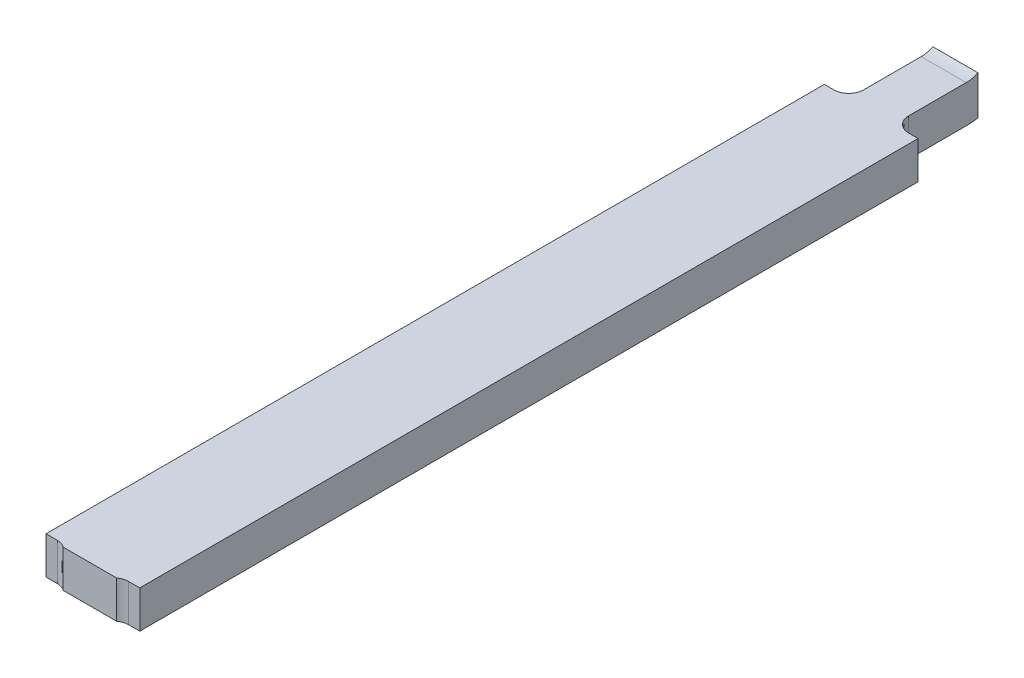
ISO-10303-21;
HEADER;
FILE_DESCRIPTION(('STEP AP214'),'2;1');
FILE_NAME('part.step','',(''),(''),'','','');
FILE_SCHEMA(('AUTOMOTIVE_DESIGN { 1 0 10303 214 1 1 1 1 }'));
ENDSEC;
DATA;
#1=APPLICATION_CONTEXT('core data for automotive mechanical design processes');
#2=APPLICATION_PROTOCOL_DEFINITION('international standard','automotive_design',2000,#1);
#3=PRODUCT_CONTEXT('',#1,'mechanical');
#4=PRODUCT('Part','Part','',(#3));
#5=PRODUCT_RELATED_PRODUCT_CATEGORY('part','',(#4));
#6=PRODUCT_DEFINITION_FORMATION('','',#4);
#7=PRODUCT_DEFINITION_CONTEXT('part definition',#1,'design');
#8=PRODUCT_DEFINITION('design','',#6,#7);
#9=PRODUCT_DEFINITION_SHAPE('','',#8);
#10=(LENGTH_UNIT() NAMED_UNIT(*) SI_UNIT(.MILLI.,.METRE.));
#11=(NAMED_UNIT(*) PLANE_ANGLE_UNIT() SI_UNIT($,.RADIAN.));
#12=(NAMED_UNIT(*) SI_UNIT($,.STERADIAN.) SOLID_ANGLE_UNIT());
#13=UNCERTAINTY_MEASURE_WITH_UNIT(LENGTH_MEASURE(1.E-05),#10,'distance_accuracy_value','');
#14=(GEOMETRIC_REPRESENTATION_CONTEXT(3) GLOBAL_UNCERTAINTY_ASSIGNED_CONTEXT((#13)) GLOBAL_UNIT_ASSIGNED_CONTEXT((#10,
#11,#12)) REPRESENTATION_CONTEXT('',''));
#15=CARTESIAN_POINT('',(0.,0.,0.));
#16=DIRECTION('',(0.,0.,1.));
#17=DIRECTION('',(1.,0.,0.));
#18=AXIS2_PLACEMENT_3D('',#15,#16,#17);
#19=CARTESIAN_POINT('',(-2.,-0.3652289464185,-7.500488855463));
#20=DIRECTION('',(0.,0.,1.));
#21=DIRECTION('',(1.,0.,0.));
#22=AXIS2_PLACEMENT_3D('',#19,#20,#21);
#23=PLANE('',#22);
#24=DIRECTION('',(0.,1.,0.));
#25=VECTOR('',#24,1.);
#26=CARTESIAN_POINT('',(-1.88,-0.3694122088881,-7.500488855463));
#27=LINE('',#26,#25);
#28=CARTESIAN_POINT('',(-1.88,-0.469296338681694,-7.50048885546298));
#29=VERTEX_POINT('',#28);
#30=CARTESIAN_POINT('',(-1.88,-0.261161554155171,-7.50048885546301));
#31=VERTEX_POINT('',#30);
#32=EDGE_CURVE('E150',#29,#31,#27,.T.);
#33=ORIENTED_EDGE('',*,*,#32,.F.);
#34=DIRECTION('',(-1.,0.,0.));
#35=VECTOR('',#34,1.);
#36=CARTESIAN_POINT('',(-1.874272716281,-0.469296338681697,-7.50048885546296));
#37=LINE('',#36,#35);
#38=CARTESIAN_POINT('',(-2.12,-0.469296338681694,-7.50048885546298));
#39=VERTEX_POINT('',#38);
#40=EDGE_CURVE('E139',#39,#29,#37,.F.);
#41=ORIENTED_EDGE('',*,*,#40,.F.);
#42=DIRECTION('',(0.,1.,0.));
#43=VECTOR('',#42,1.);
#44=CARTESIAN_POINT('',(-2.12,-0.3694122088881,-7.500488855463));
#45=LINE('',#44,#43);
#46=CARTESIAN_POINT('',(-2.12,-0.261161554155171,-7.50048885546301));
#47=VERTEX_POINT('',#46);
#48=EDGE_CURVE('E535',#39,#47,#45,.T.);
#49=ORIENTED_EDGE('',*,*,#48,.T.);
#50=DIRECTION('',(1.,0.,0.));
#51=VECTOR('',#50,1.);
#52=CARTESIAN_POINT('',(-2.125727283719,-0.261161554155164,-7.50048885546303));
#53=LINE('',#52,#51);
#54=EDGE_CURVE('E147',#47,#31,#53,.T.);
#55=ORIENTED_EDGE('',*,*,#54,.T.);
#56=EDGE_LOOP('',(#33,#41,#49,#55));
#57=FACE_BOUND('',#56,.T.);
#58=ADVANCED_FACE('F17',(#57),#23,.F.);
#59=CARTESIAN_POINT('',(-1.874272716281,-0.125,-7.43756007691));
#60=DIRECTION('',(-1.,0.,0.));
#61=DIRECTION('',(0.,0.,1.));
#62=AXIS2_PLACEMENT_3D('',#59,#60,#61);
#63=CYLINDRICAL_SURFACE('',#62,0.3499999999997);
#64=CARTESIAN_POINT('',(-2.12,-0.125,-7.43756007691));
#65=DIRECTION('',(-1.,0.,0.));
#66=DIRECTION('',(0.,0.,1.));
#67=AXIS2_PLACEMENT_3D('',#64,#65,#66);
#68=CIRCLE('',#67,0.3499999999997);
#69=CARTESIAN_POINT('',(-2.12,-0.475,-7.43756007691));
#70=VERTEX_POINT('',#69);
#71=EDGE_CURVE('E250',#70,#39,#68,.F.);
#72=ORIENTED_EDGE('',*,*,#71,.T.);
#73=ORIENTED_EDGE('',*,*,#40,.T.);
#74=CARTESIAN_POINT('',(-1.88,-0.125,-7.43756007691));
#75=DIRECTION('',(-1.,0.,0.));
#76=DIRECTION('',(0.,0.,1.));
#77=AXIS2_PLACEMENT_3D('',#74,#75,#76);
#78=CIRCLE('',#77,0.3499999999997);
#79=CARTESIAN_POINT('',(-1.88,-0.475,-7.43756007691));
#80=VERTEX_POINT('',#79);
#81=EDGE_CURVE('E274',#80,#29,#78,.F.);
#82=ORIENTED_EDGE('',*,*,#81,.F.);
#83=DIRECTION('',(1.,0.,0.));
#84=VECTOR('',#83,1.);
#85=CARTESIAN_POINT('',(-2.,-0.475,-7.43756007691));
#86=LINE('',#85,#84);
#87=EDGE_CURVE('E138',#80,#70,#86,.F.);
#88=ORIENTED_EDGE('',*,*,#87,.T.);
#89=EDGE_LOOP('',(#72,#73,#82,#88));
#90=FACE_BOUND('',#89,.T.);
#91=ADVANCED_FACE('F255',(#90),#63,.T.);
#92=CARTESIAN_POINT('',(-2.,-0.475,-5.160844573418));
#93=DIRECTION('',(0.,1.,0.));
#94=DIRECTION('',(0.,0.,1.));
#95=AXIS2_PLACEMENT_3D('',#92,#93,#94);
#96=PLANE('',#95);
#97=DIRECTION('',(1.,0.,0.));
#98=VECTOR('',#97,1.);
#99=CARTESIAN_POINT('',(-2.,-0.475,-2.9));
#100=LINE('',#99,#98);
#101=CARTESIAN_POINT('',(-2.25,-0.475,-2.9));
#102=VERTEX_POINT('',#101);
#103=CARTESIAN_POINT('',(-2.19,-0.475,-2.89999999999976));
#104=VERTEX_POINT('',#103);
#105=EDGE_CURVE('E118',#102,#104,#100,.T.);
#106=ORIENTED_EDGE('',*,*,#105,.F.);
#107=DIRECTION('',(0.,0.,-1.));
#108=VECTOR('',#107,1.);
#109=CARTESIAN_POINT('',(-2.25,-0.475,-4.975579331992));
#110=LINE('',#109,#108);
#111=CARTESIAN_POINT('',(-2.25,-0.475,-7.051158663985));
#112=VERTEX_POINT('',#111);
#113=EDGE_CURVE('E213',#102,#112,#110,.T.);
#114=ORIENTED_EDGE('',*,*,#113,.T.);
#115=DIRECTION('',(1.,0.,0.));
#116=VECTOR('',#115,1.);
#117=CARTESIAN_POINT('',(-2.225,-0.475,-7.051158663985));
#118=LINE('',#117,#116);
#119=CARTESIAN_POINT('',(-2.2,-0.475,-7.05115866398505));
#120=VERTEX_POINT('',#119);
#121=EDGE_CURVE('E218',#112,#120,#118,.T.);
#122=ORIENTED_EDGE('',*,*,#121,.T.);
#123=CARTESIAN_POINT('',(-2.11999999999968,-0.475,-7.131158663985));
#124=CARTESIAN_POINT('',(-2.12000887559487,-0.475,-7.12663228539965));
#125=CARTESIAN_POINT('',(-2.12039503047314,-0.475,-7.12211245444064));
#126=CARTESIAN_POINT('',(-2.12191562674135,-0.475,-7.11320506981294));
#127=CARTESIAN_POINT('',(-2.12304939310095,-0.475,-7.10881740054697));
#128=CARTESIAN_POINT('',(-2.12755618553401,-0.475,-7.09604021502532));
#129=CARTESIAN_POINT('',(-2.13203481865041,-0.475,-7.08801257629076));
#130=CARTESIAN_POINT('',(-2.14334118864267,-0.475,-7.07397145931291));
#131=CARTESIAN_POINT('',(-2.15014907486863,-0.475,-7.06794178198466));
#132=CARTESIAN_POINT('',(-2.16542981568034,-0.475,-7.05845747919415));
#133=CARTESIAN_POINT('',(-2.17391091624522,-0.475,-7.05501603051907));
#134=CARTESIAN_POINT('',(-2.18838450867069,-0.475,-7.05178938735803));
#135=CARTESIAN_POINT('',(-2.19419660039156,-0.475,-7.05114165155808));
#136=CARTESIAN_POINT('',(-2.2,-0.475,-7.05115866398511));
#137=B_SPLINE_CURVE_WITH_KNOTS('',3,(#123,#124,#125,#126,#127,#128,#129,#130,#131,#132,#133,
#134,#135,#136),.UNSPECIFIED.,.F.,.F.,(4,2,2,2,2,2,4),(0.,0.0135512792184647,0.0270903394942153,
0.0541002294468976,0.0808854407469148,0.107806110463973,0.125207976056708),.UNSPECIFIED.);
#138=CARTESIAN_POINT('',(-2.11999999999984,-0.475,-7.131158663985));
#139=VERTEX_POINT('',#138);
#140=EDGE_CURVE('E239',#139,#120,#137,.T.);
#141=ORIENTED_EDGE('',*,*,#140,.F.);
#142=DIRECTION('',(0.,0.,-1.));
#143=VECTOR('',#142,1.);
#144=CARTESIAN_POINT('',(-2.12,-0.475,-7.317732357319));
#145=LINE('',#144,#143);
#146=EDGE_CURVE('E537',#139,#70,#145,.T.);
#147=ORIENTED_EDGE('',*,*,#146,.T.);
#148=ORIENTED_EDGE('',*,*,#87,.F.);
#149=DIRECTION('',(0.,0.,-1.));
#150=VECTOR('',#149,1.);
#151=CARTESIAN_POINT('',(-1.88,-0.475,-7.317732357319));
#152=LINE('',#151,#150);
#153=CARTESIAN_POINT('',(-1.87999999999995,-0.475,-7.131158663985));
#154=VERTEX_POINT('',#153);
#155=EDGE_CURVE('E533',#154,#80,#152,.T.);
#156=ORIENTED_EDGE('',*,*,#155,.F.);
#157=CARTESIAN_POINT('',(-1.8,-0.475,-7.05115866398468));
#158=CARTESIAN_POINT('',(-1.80452637858536,-0.475,-7.05116753957987));
#159=CARTESIAN_POINT('',(-1.80904620954437,-0.475,-7.05155369445814));
#160=CARTESIAN_POINT('',(-1.81795359417208,-0.475,-7.05307429072635));
#161=CARTESIAN_POINT('',(-1.82234126343806,-0.475,-7.05420805708595));
#162=CARTESIAN_POINT('',(-1.83511844895972,-0.475,-7.05871484951903));
#163=CARTESIAN_POINT('',(-1.84314608769428,-0.475,-7.06319348263544));
#164=CARTESIAN_POINT('',(-1.85718720467213,-0.475,-7.07449985262771));
#165=CARTESIAN_POINT('',(-1.86321688200037,-0.475,-7.08130773885368));
#166=CARTESIAN_POINT('',(-1.87270118479088,-0.475,-7.09658847966539));
#167=CARTESIAN_POINT('',(-1.87614263346595,-0.475,-7.10506958023027));
#168=CARTESIAN_POINT('',(-1.87936927662698,-0.475,-7.11954317265572));
#169=CARTESIAN_POINT('',(-1.88001701242693,-0.475,-7.12535526437658));
#170=CARTESIAN_POINT('',(-1.87999999999989,-0.475,-7.131158663985));
#171=B_SPLINE_CURVE_WITH_KNOTS('',3,(#157,#158,#159,#160,#161,#162,#163,#164,#165,#166,#167,
#168,#169,#170),.UNSPECIFIED.,.F.,.F.,(4,2,2,2,2,2,4),(0.,0.0135512792184802,0.027090339494244,
0.0541002294469579,0.0808854407469674,0.107806110464019,0.125207976056707),.UNSPECIFIED.);
#172=CARTESIAN_POINT('',(-1.8,-0.475,-7.05115866398484));
#173=VERTEX_POINT('',#172);
#174=EDGE_CURVE('E266',#173,#154,#171,.T.);
#175=ORIENTED_EDGE('',*,*,#174,.F.);
#176=DIRECTION('',(1.,0.,0.));
#177=VECTOR('',#176,1.);
#178=CARTESIAN_POINT('',(-1.775,-0.475,-7.051158663985));
#179=LINE('',#178,#177);
#180=CARTESIAN_POINT('',(-1.75,-0.475,-7.051158663985));
#181=VERTEX_POINT('',#180);
#182=EDGE_CURVE('E151',#173,#181,#179,.T.);
#183=ORIENTED_EDGE('',*,*,#182,.T.);
#184=DIRECTION('',(0.,0.,-1.));
#185=VECTOR('',#184,1.);
#186=CARTESIAN_POINT('',(-1.75,-0.475,-4.975579331992));
#187=LINE('',#186,#185);
#188=CARTESIAN_POINT('',(-1.75,-0.475,-2.9));
#189=VERTEX_POINT('',#188);
#190=EDGE_CURVE('E155',#189,#181,#187,.T.);
#191=ORIENTED_EDGE('',*,*,#190,.F.);
#192=DIRECTION('',(1.,0.,0.));
#193=VECTOR('',#192,1.);
#194=CARTESIAN_POINT('',(-1.78,-0.475,-2.9));
#195=LINE('',#194,#193);
#196=CARTESIAN_POINT('',(-1.81,-0.475,-2.89999999999989));
#197=VERTEX_POINT('',#196);
#198=EDGE_CURVE('E163',#197,#189,#195,.T.);
#199=ORIENTED_EDGE('',*,*,#198,.F.);
#200=CARTESIAN_POINT('',(-1.85782455242115,-0.475,-2.8841290699251));
#201=CARTESIAN_POINT('',(-1.85377977929529,-0.475,-2.88715347788678));
#202=CARTESIAN_POINT('',(-1.8494455741793,-0.475,-2.88978498732686));
#203=CARTESIAN_POINT('',(-1.84086630502368,-0.475,-2.8939430866676));
#204=CARTESIAN_POINT('',(-1.83666481589101,-0.475,-2.89555994023161));
#205=CARTESIAN_POINT('',(-1.828051190578,-0.475,-2.89806057790455));
#206=CARTESIAN_POINT('',(-1.82363918895056,-0.475,-2.898944823807));
#207=CARTESIAN_POINT('',(-1.81613636516881,-0.475,-2.89981357444961));
#208=CARTESIAN_POINT('',(-1.81306715843202,-0.475,-2.89999375978714));
#209=CARTESIAN_POINT('',(-1.81,-0.475,-2.89999999999978));
#210=B_SPLINE_CURVE_WITH_KNOTS('',3,(#200,#201,#202,#203,#204,#205,#206,#207,#208,#209),
.UNSPECIFIED.,.F.,.F.,(4,2,2,2,4),(0.,0.015122324842842,0.028564897266312,0.0419989898086834,
0.0512012871013957),.UNSPECIFIED.);
#211=CARTESIAN_POINT('',(-1.85782455242108,-0.475,-2.88412906992505));
#212=VERTEX_POINT('',#211);
#213=EDGE_CURVE('E125',#212,#197,#210,.T.);
#214=ORIENTED_EDGE('',*,*,#213,.F.);
#215=DIRECTION('',(1.,0.,0.));
#216=VECTOR('',#215,1.);
#217=CARTESIAN_POINT('',(-2.,-0.475,-2.884129069925));
#218=LINE('',#217,#216);
#219=CARTESIAN_POINT('',(-2.14217543362795,-0.475,-2.88412906992502));
#220=VERTEX_POINT('',#219);
#221=EDGE_CURVE('E129',#220,#212,#218,.T.);
#222=ORIENTED_EDGE('',*,*,#221,.F.);
#223=CARTESIAN_POINT('',(-2.19,-0.475,-2.89999999999952));
#224=CARTESIAN_POINT('',(-2.18496730361836,-0.475,-2.90001482409384));
#225=CARTESIAN_POINT('',(-2.17991815783308,-0.475,-2.89952557596737));
#226=CARTESIAN_POINT('',(-2.16614771604894,-0.475,-2.89686256447201));
#227=CARTESIAN_POINT('',(-2.15760052391877,-0.475,-2.89367998586962));
#228=CARTESIAN_POINT('',(-2.14719213429874,-0.475,-2.88765952253235));
#229=CARTESIAN_POINT('',(-2.14462559871613,-0.475,-2.88596721904186));
#230=CARTESIAN_POINT('',(-2.1421754336279,-0.475,-2.88412906992503));
#231=B_SPLINE_CURVE_WITH_KNOTS('',3,(#223,#224,#225,#226,#227,#228,#229,#230),.UNSPECIFIED.,.F.,
.F.,(4,2,2,4),(0.,0.015117895101051,0.0419060489798976,0.0511063402020688),.UNSPECIFIED.);
#232=EDGE_CURVE('E20',#104,#220,#231,.T.);
#233=ORIENTED_EDGE('',*,*,#232,.F.);
#234=EDGE_LOOP('',(#106,#114,#122,#141,#147,#148,#156,#175,#183,#191,#199,#214,#222,#233));
#235=FACE_BOUND('',#234,.T.);
#236=ADVANCED_FACE('F135',(#235),#96,.F.);
#237=CARTESIAN_POINT('',(-1.807132391521,-0.269272716281,-2.899957930186));
#238=CARTESIAN_POINT('',(-1.808087324483,-0.269272716281,-2.899988554812));
#239=CARTESIAN_POINT('',(-1.814268512342,-0.269272716281,-2.900079343105));
#240=CARTESIAN_POINT('',(-1.825708586311,-0.269272716281,-2.898963559635));
#241=CARTESIAN_POINT('',(-1.840809082916,-0.269272716281,-2.894390814224));
#242=CARTESIAN_POINT('',(-1.8513126737,-0.269272716281,-2.888776760997));
#243=CARTESIAN_POINT('',(-1.858278976833,-0.269272716281,-2.883851645707));
#244=CARTESIAN_POINT('',(-1.860847948139,-0.269272716281,-2.881786274905));
#245=CARTESIAN_POINT('',(-1.862294521887,-0.269272716281,-2.880535760884));
#246=(BOUNDED_CURVE() B_SPLINE_CURVE(3,(#237,#238,#239,#240,#241,#242,#243,#244,#245),
.UNSPECIFIED.,.F.,.F.) B_SPLINE_CURVE_WITH_KNOTS((4,1,1,1,1,1,4),(0.,0.04800761260771,
0.3103664664067,0.5726487803877,0.8349383013298,0.9041878403074,1.),
.UNSPECIFIED.) CURVE() GEOMETRIC_REPRESENTATION_ITEM() RATIONAL_B_SPLINE_CURVE((1.,1.,1.,1.,1.,
1.,1.,1.,1.)) REPRESENTATION_ITEM(''));
#247=DIRECTION('',(0.,-1.,0.));
#248=VECTOR('',#247,1.);
#249=SURFACE_OF_LINEAR_EXTRUSION('',#246,#248);
#250=CARTESIAN_POINT('',(-1.85782455535254,-0.275,-2.88412906773656));
#251=CARTESIAN_POINT('',(-1.85377978236567,-0.275,-2.88715347588347));
#252=CARTESIAN_POINT('',(-1.84944557737024,-0.275,-2.88978498552233));
#253=CARTESIAN_POINT('',(-1.84086630840599,-0.275,-2.89394308525624));
#254=CARTESIAN_POINT('',(-1.83666481934833,-0.275,-2.89555993901276));
#255=CARTESIAN_POINT('',(-1.82805119415028,-0.275,-2.89806057708111));
#256=CARTESIAN_POINT('',(-1.82363919256269,-0.275,-2.89894482318606));
#257=CARTESIAN_POINT('',(-1.81613636760675,-0.275,-2.89981357430863));
#258=CARTESIAN_POINT('',(-1.81306715965085,-0.275,-2.89999375978684));
#259=CARTESIAN_POINT('',(-1.81,-0.275,-2.89999999999978));
#260=B_SPLINE_CURVE_WITH_KNOTS('',3,(#250,#251,#252,#253,#254,#255,#256,#257,#258,#259),
.UNSPECIFIED.,.F.,.F.,(4,2,2,2,4),(0.,0.0151223248426725,0.0285648972632358,0.0419989898096449,
0.0512012907536541),.UNSPECIFIED.);
#261=CARTESIAN_POINT('',(-1.85782455388677,-0.275,-2.88412906883078));
#262=VERTEX_POINT('',#261);
#263=CARTESIAN_POINT('',(-1.81,-0.275,-2.9));
#264=VERTEX_POINT('',#263);
#265=EDGE_CURVE('E132',#262,#264,#260,.T.);
#266=ORIENTED_EDGE('',*,*,#265,.F.);
#267=DIRECTION('',(0.,1.,0.));
#268=VECTOR('',#267,1.);
#269=CARTESIAN_POINT('',(-1.857824552421,-0.375,-2.884129069925));
#270=LINE('',#269,#268);
#271=EDGE_CURVE('E133',#212,#262,#270,.T.);
#272=ORIENTED_EDGE('',*,*,#271,.F.);
#273=ORIENTED_EDGE('',*,*,#213,.T.);
#274=DIRECTION('',(0.,1.,0.));
#275=VECTOR('',#274,1.);
#276=CARTESIAN_POINT('',(-1.81,-0.375,-2.9));
#277=LINE('',#276,#275);
#278=EDGE_CURVE('E166',#264,#197,#277,.F.);
#279=ORIENTED_EDGE('',*,*,#278,.F.);
#280=EDGE_LOOP('',(#266,#272,#273,#279));
#281=FACE_BOUND('',#280,.T.);
#282=ADVANCED_FACE('F254',(#281),#249,.T.);
#283=CARTESIAN_POINT('',(-1.78,-0.375,-2.9));
#284=DIRECTION('',(0.,0.,1.));
#285=DIRECTION('',(1.,0.,0.));
#286=AXIS2_PLACEMENT_3D('',#283,#284,#285);
#287=PLANE('',#286);
#288=DIRECTION('',(0.,1.,0.));
#289=VECTOR('',#288,1.);
#290=CARTESIAN_POINT('',(-1.75,-0.375,-2.9));
#291=LINE('',#290,#289);
#292=CARTESIAN_POINT('',(-1.75,-0.275,-2.9));
#293=VERTEX_POINT('',#292);
#294=EDGE_CURVE('E160',#293,#189,#291,.F.);
#295=ORIENTED_EDGE('',*,*,#294,.F.);
#296=DIRECTION('',(1.,0.,0.));
#297=VECTOR('',#296,1.);
#298=CARTESIAN_POINT('',(-2.,-0.275,-2.9));
#299=LINE('',#298,#297);
#300=EDGE_CURVE('E306',#264,#293,#299,.T.);
#301=ORIENTED_EDGE('',*,*,#300,.F.);
#302=ORIENTED_EDGE('',*,*,#278,.T.);
#303=ORIENTED_EDGE('',*,*,#198,.T.);
#304=EDGE_LOOP('',(#295,#301,#302,#303));
#305=FACE_BOUND('',#304,.T.);
#306=ADVANCED_FACE('F368',(#305),#287,.T.);
#307=CARTESIAN_POINT('',(-1.75,-0.375,-4.975579331992));
#308=DIRECTION('',(1.,0.,0.));
#309=DIRECTION('',(0.,0.,-1.));
#310=AXIS2_PLACEMENT_3D('',#307,#308,#309);
#311=PLANE('',#310);
#312=DIRECTION('',(0.,1.,0.));
#313=VECTOR('',#312,1.);
#314=CARTESIAN_POINT('',(-1.75,-0.375,-7.051158663985));
#315=LINE('',#314,#313);
#316=CARTESIAN_POINT('',(-1.75,-0.275,-7.051158663985));
#317=VERTEX_POINT('',#316);
#318=EDGE_CURVE('E154',#181,#317,#315,.T.);
#319=ORIENTED_EDGE('',*,*,#318,.T.);
#320=DIRECTION('',(0.,0.,1.));
#321=VECTOR('',#320,1.);
#322=CARTESIAN_POINT('',(-1.75,-0.275,-5.160844573418));
#323=LINE('',#322,#321);
#324=EDGE_CURVE('E302',#293,#317,#323,.F.);
#325=ORIENTED_EDGE('',*,*,#324,.F.);
#326=ORIENTED_EDGE('',*,*,#294,.T.);
#327=ORIENTED_EDGE('',*,*,#190,.T.);
#328=EDGE_LOOP('',(#319,#325,#326,#327));
#329=FACE_BOUND('',#328,.T.);
#330=ADVANCED_FACE('F373',(#329),#311,.T.);
#331=CARTESIAN_POINT('',(-1.775,-0.375,-7.051158663985));
#332=DIRECTION('',(0.,0.,1.));
#333=DIRECTION('',(1.,0.,0.));
#334=AXIS2_PLACEMENT_3D('',#331,#332,#333);
#335=PLANE('',#334);
#336=ORIENTED_EDGE('',*,*,#182,.F.);
#337=DIRECTION('',(0.,-1.,0.));
#338=VECTOR('',#337,1.);
#339=CARTESIAN_POINT('',(-1.8,-0.269272716281,-7.05115866398468));
#340=LINE('',#339,#338);
#341=CARTESIAN_POINT('',(-1.8,-0.275,-7.05115866398476));
#342=VERTEX_POINT('',#341);
#343=EDGE_CURVE('E273',#342,#173,#340,.T.);
#344=ORIENTED_EDGE('',*,*,#343,.F.);
#345=DIRECTION('',(1.,0.,0.));
#346=VECTOR('',#345,1.);
#347=CARTESIAN_POINT('',(-2.,-0.275,-7.051158663985));
#348=LINE('',#347,#346);
#349=EDGE_CURVE('E305',#317,#342,#348,.F.);
#350=ORIENTED_EDGE('',*,*,#349,.F.);
#351=ORIENTED_EDGE('',*,*,#318,.F.);
#352=EDGE_LOOP('',(#336,#344,#350,#351));
#353=FACE_BOUND('',#352,.T.);
#354=ADVANCED_FACE('F283',(#353),#335,.F.);
#355=CARTESIAN_POINT('',(-1.879957929587,-0.269272716281,-7.134026291144));
#356=CARTESIAN_POINT('',(-1.879988554629,-0.269272716281,-7.133071351971));
#357=CARTESIAN_POINT('',(-1.880079343715,-0.269272716281,-7.126890157897));
#358=CARTESIAN_POINT('',(-1.878963559635,-0.269272716281,-7.115450077674));
#359=CARTESIAN_POINT('',(-1.874390814224,-0.269272716281,-7.100349581069));
#360=CARTESIAN_POINT('',(-1.866951052025,-0.269272716281,-7.086430187272));
#361=CARTESIAN_POINT('',(-1.856931304376,-0.269272716281,-7.074236320435));
#362=CARTESIAN_POINT('',(-1.844737903504,-0.269272716281,-7.064213675467));
#363=CARTESIAN_POINT('',(-1.830816201624,-0.269272716281,-7.056770327068));
#364=CARTESIAN_POINT('',(-1.815712040492,-0.269272716281,-7.05219575577));
#365=CARTESIAN_POINT('',(-1.804270485404,-0.269272716281,-7.051079350384));
#366=CARTESIAN_POINT('',(-1.798089320739,-0.269272716281,-7.051170096432));
#367=CARTESIAN_POINT('',(-1.797135381259,-0.269272716281,-7.0512006723));
#368=(BOUNDED_CURVE() B_SPLINE_CURVE(3,(#355,#356,#357,#358,#359,#360,#361,#362,#363,#364,#365,
#366,#367),.UNSPECIFIED.,.F.,.F.) B_SPLINE_CURVE_WITH_KNOTS((4,1,1,1,1,1,1,1,1,1,4),(0.,
0.02187366901521,0.1414112381412,0.260913933719,0.380419912977,0.4999590271853,0.6195124003892,
0.7390518477007,0.8585895788734,0.9781493142558,1.),
.UNSPECIFIED.) CURVE() GEOMETRIC_REPRESENTATION_ITEM() RATIONAL_B_SPLINE_CURVE((1.,1.,1.,1.,1.,
1.,1.,1.,1.,1.,1.,1.,1.)) REPRESENTATION_ITEM(''));
#369=DIRECTION('',(0.,-1.,0.));
#370=VECTOR('',#369,1.);
#371=SURFACE_OF_LINEAR_EXTRUSION('',#368,#370);
#372=DIRECTION('',(0.,1.,0.));
#373=VECTOR('',#372,1.);
#374=CARTESIAN_POINT('',(-1.88,-0.3694122088881,-7.131158663985));
#375=LINE('',#374,#373);
#376=CARTESIAN_POINT('',(-1.88,-0.275,-7.131158663985));
#377=VERTEX_POINT('',#376);
#378=EDGE_CURVE('E272',#377,#154,#375,.F.);
#379=ORIENTED_EDGE('',*,*,#378,.F.);
#380=CARTESIAN_POINT('',(-1.8,-0.275,-7.05115866398468));
#381=CARTESIAN_POINT('',(-1.80452637858536,-0.275,-7.05116753957987));
#382=CARTESIAN_POINT('',(-1.80904620954437,-0.275,-7.05155369445814));
#383=CARTESIAN_POINT('',(-1.81795359417208,-0.275,-7.05307429072635));
#384=CARTESIAN_POINT('',(-1.82234126343806,-0.275,-7.05420805708595));
#385=CARTESIAN_POINT('',(-1.83511844895972,-0.275,-7.05871484951903));
#386=CARTESIAN_POINT('',(-1.84314608769428,-0.275,-7.06319348263544));
#387=CARTESIAN_POINT('',(-1.85718720467213,-0.275,-7.07449985262771));
#388=CARTESIAN_POINT('',(-1.86321688200037,-0.275,-7.08130773885368));
#389=CARTESIAN_POINT('',(-1.87270118479088,-0.275,-7.09658847966539));
#390=CARTESIAN_POINT('',(-1.87614263346595,-0.275,-7.10506958023027));
#391=CARTESIAN_POINT('',(-1.87936927662698,-0.275,-7.11954317265572));
#392=CARTESIAN_POINT('',(-1.88001701242693,-0.275,-7.12535526437658));
#393=CARTESIAN_POINT('',(-1.87999999999989,-0.275,-7.131158663985));
#394=B_SPLINE_CURVE_WITH_KNOTS('',3,(#380,#381,#382,#383,#384,#385,#386,#387,#388,#389,#390,
#391,#392,#393),.UNSPECIFIED.,.F.,.F.,(4,2,2,2,2,2,4),(0.,0.0135512792184802,0.027090339494244,
0.0541002294469579,0.0808854407469674,0.107806110464019,0.125207976056707),.UNSPECIFIED.);
#395=EDGE_CURVE('E355',#342,#377,#394,.T.);
#396=ORIENTED_EDGE('',*,*,#395,.F.);
#397=ORIENTED_EDGE('',*,*,#343,.T.);
#398=ORIENTED_EDGE('',*,*,#174,.T.);
#399=EDGE_LOOP('',(#379,#396,#397,#398));
#400=FACE_BOUND('',#399,.T.);
#401=ADVANCED_FACE('F276',(#400),#371,.T.);
#402=CARTESIAN_POINT('',(-1.88,-0.3694122088881,-7.317732357319));
#403=DIRECTION('',(1.,0.,0.));
#404=DIRECTION('',(0.,0.,-1.));
#405=AXIS2_PLACEMENT_3D('',#402,#403,#404);
#406=PLANE('',#405);
#407=ORIENTED_EDGE('',*,*,#81,.T.);
#408=ORIENTED_EDGE('',*,*,#32,.T.);
#409=CARTESIAN_POINT('',(-1.88,-0.125,-7.437560076911));
#410=DIRECTION('',(1.,0.,0.));
#411=DIRECTION('',(0.,0.,-1.));
#412=AXIS2_PLACEMENT_3D('',#409,#410,#411);
#413=CIRCLE('',#412,0.15);
#414=CARTESIAN_POINT('',(-1.88,-0.275,-7.437560076911));
#415=VERTEX_POINT('',#414);
#416=EDGE_CURVE('E149',#31,#415,#413,.F.);
#417=ORIENTED_EDGE('',*,*,#416,.T.);
#418=DIRECTION('',(0.,0.,1.));
#419=VECTOR('',#418,1.);
#420=CARTESIAN_POINT('',(-1.88,-0.275,-5.160844573418));
#421=LINE('',#420,#419);
#422=EDGE_CURVE('E348',#377,#415,#421,.F.);
#423=ORIENTED_EDGE('',*,*,#422,.F.);
#424=ORIENTED_EDGE('',*,*,#378,.T.);
#425=ORIENTED_EDGE('',*,*,#155,.T.);
#426=EDGE_LOOP('',(#407,#408,#417,#423,#424,#425));
#427=FACE_BOUND('',#426,.T.);
#428=ADVANCED_FACE('F282',(#427),#406,.T.);
#429=CARTESIAN_POINT('',(-2.125727283719,-0.125,-7.437560076911));
#430=DIRECTION('',(1.,0.,0.));
#431=DIRECTION('',(0.,0.,-1.));
#432=AXIS2_PLACEMENT_3D('',#429,#430,#431);
#433=CYLINDRICAL_SURFACE('',#432,0.15);
#434=DIRECTION('',(1.,0.,0.));
#435=VECTOR('',#434,1.);
#436=CARTESIAN_POINT('',(-2.,-0.275,-7.437560076911));
#437=LINE('',#436,#435);
#438=CARTESIAN_POINT('',(-2.12,-0.275,-7.437560076911));
#439=VERTEX_POINT('',#438);
#440=EDGE_CURVE('E346',#415,#439,#437,.F.);
#441=ORIENTED_EDGE('',*,*,#440,.F.);
#442=ORIENTED_EDGE('',*,*,#416,.F.);
#443=ORIENTED_EDGE('',*,*,#54,.F.);
#444=CARTESIAN_POINT('',(-2.12,-0.125,-7.437560076911));
#445=DIRECTION('',(1.,0.,0.));
#446=DIRECTION('',(0.,0.,-1.));
#447=AXIS2_PLACEMENT_3D('',#444,#445,#446);
#448=CIRCLE('',#447,0.15);
#449=EDGE_CURVE('E536',#47,#439,#448,.F.);
#450=ORIENTED_EDGE('',*,*,#449,.T.);
#451=EDGE_LOOP('',(#441,#442,#443,#450));
#452=FACE_BOUND('',#451,.T.);
#453=ADVANCED_FACE('F443',(#452),#433,.F.);
#454=CARTESIAN_POINT('',(-2.12,-0.3694122088881,-7.317732357319));
#455=DIRECTION('',(1.,0.,0.));
#456=DIRECTION('',(0.,0.,-1.));
#457=AXIS2_PLACEMENT_3D('',#454,#455,#456);
#458=PLANE('',#457);
#459=ORIENTED_EDGE('',*,*,#146,.F.);
#460=DIRECTION('',(0.,-1.,0.));
#461=VECTOR('',#460,1.);
#462=CARTESIAN_POINT('',(-2.11999999999968,-0.269272716281,-7.131158663985));
#463=LINE('',#462,#461);
#464=CARTESIAN_POINT('',(-2.11999999999976,-0.275,-7.131158663985));
#465=VERTEX_POINT('',#464);
#466=EDGE_CURVE('E223',#465,#139,#463,.T.);
#467=ORIENTED_EDGE('',*,*,#466,.F.);
#468=DIRECTION('',(0.,0.,1.));
#469=VECTOR('',#468,1.);
#470=CARTESIAN_POINT('',(-2.12,-0.275,-5.160844573418));
#471=LINE('',#470,#469);
#472=EDGE_CURVE('E345',#439,#465,#471,.T.);
#473=ORIENTED_EDGE('',*,*,#472,.F.);
#474=ORIENTED_EDGE('',*,*,#449,.F.);
#475=ORIENTED_EDGE('',*,*,#48,.F.);
#476=ORIENTED_EDGE('',*,*,#71,.F.);
#477=EDGE_LOOP('',(#459,#467,#473,#474,#475,#476));
#478=FACE_BOUND('',#477,.T.);
#479=ADVANCED_FACE('F234',(#478),#458,.F.);
#480=CARTESIAN_POINT('',(-2.202867627159,-0.269272716281,-7.051200734398));
#481=CARTESIAN_POINT('',(-2.201912687986,-0.269272716281,-7.051170109356));
#482=CARTESIAN_POINT('',(-2.195731493912,-0.269272716281,-7.05107932027));
#483=CARTESIAN_POINT('',(-2.184291413689,-0.269272716281,-7.05219510435));
#484=CARTESIAN_POINT('',(-2.169190917084,-0.269272716281,-7.056767849761));
#485=CARTESIAN_POINT('',(-2.155271523287,-0.269272716281,-7.06420761196));
#486=CARTESIAN_POINT('',(-2.14307765645,-0.269272716281,-7.074227359609));
#487=CARTESIAN_POINT('',(-2.133055011482,-0.269272716281,-7.086420760481));
#488=CARTESIAN_POINT('',(-2.125611663083,-0.269272716281,-7.100342462361));
#489=CARTESIAN_POINT('',(-2.121037091785,-0.269272716281,-7.115446623493));
#490=CARTESIAN_POINT('',(-2.119920686399,-0.269272716281,-7.126888178581));
#491=CARTESIAN_POINT('',(-2.120011432447,-0.269272716281,-7.133069343246));
#492=CARTESIAN_POINT('',(-2.120042008315,-0.269272716281,-7.134023282726));
#493=(BOUNDED_CURVE() B_SPLINE_CURVE(3,(#480,#481,#482,#483,#484,#485,#486,#487,#488,#489,#490,
#491,#492),.UNSPECIFIED.,.F.,.F.) B_SPLINE_CURVE_WITH_KNOTS((4,1,1,1,1,1,1,1,1,1,4),(0.,
0.02187366901522,0.1414112381413,0.260913933719,0.380419912977,0.4999590271853,0.6195124003892,
0.7390518477007,0.8585895788734,0.9781493142558,1.),
.UNSPECIFIED.) CURVE() GEOMETRIC_REPRESENTATION_ITEM() RATIONAL_B_SPLINE_CURVE((1.,1.,1.,1.,1.,
1.,1.,1.,1.,1.,1.,1.,1.)) REPRESENTATION_ITEM(''));
#494=DIRECTION('',(0.,-1.,0.));
#495=VECTOR('',#494,1.);
#496=SURFACE_OF_LINEAR_EXTRUSION('',#493,#495);
#497=DIRECTION('',(0.,1.,0.));
#498=VECTOR('',#497,1.);
#499=CARTESIAN_POINT('',(-2.2,-0.375,-7.051158663985));
#500=LINE('',#499,#498);
#501=CARTESIAN_POINT('',(-2.2,-0.275,-7.051158663985));
#502=VERTEX_POINT('',#501);
#503=EDGE_CURVE('E216',#120,#502,#500,.T.);
#504=ORIENTED_EDGE('',*,*,#503,.T.);
#505=CARTESIAN_POINT('',(-2.11999999999968,-0.275,-7.131158663985));
#506=CARTESIAN_POINT('',(-2.12000887559487,-0.275,-7.12663228539965));
#507=CARTESIAN_POINT('',(-2.12039503047314,-0.275,-7.12211245444064));
#508=CARTESIAN_POINT('',(-2.12191562674135,-0.275,-7.11320506981294));
#509=CARTESIAN_POINT('',(-2.12304939310095,-0.275,-7.10881740054697));
#510=CARTESIAN_POINT('',(-2.12755618553401,-0.275,-7.09604021502532));
#511=CARTESIAN_POINT('',(-2.13203481865041,-0.275,-7.08801257629076));
#512=CARTESIAN_POINT('',(-2.14334118864267,-0.275,-7.07397145931291));
#513=CARTESIAN_POINT('',(-2.15014907486863,-0.275,-7.06794178198466));
#514=CARTESIAN_POINT('',(-2.16542981568034,-0.275,-7.05845747919415));
#515=CARTESIAN_POINT('',(-2.17391091624522,-0.275,-7.05501603051907));
#516=CARTESIAN_POINT('',(-2.18838450867069,-0.275,-7.05178938735803));
#517=CARTESIAN_POINT('',(-2.19419660039156,-0.275,-7.05114165155808));
#518=CARTESIAN_POINT('',(-2.2,-0.275,-7.05115866398511));
#519=B_SPLINE_CURVE_WITH_KNOTS('',3,(#505,#506,#507,#508,#509,#510,#511,#512,#513,#514,#515,
#516,#517,#518),.UNSPECIFIED.,.F.,.F.,(4,2,2,2,2,2,4),(0.,0.0135512792184647,0.0270903394942153,
0.0541002294468976,0.0808854407469148,0.107806110463973,0.125207976056708),.UNSPECIFIED.);
#520=EDGE_CURVE('E175',#465,#502,#519,.T.);
#521=ORIENTED_EDGE('',*,*,#520,.F.);
#522=ORIENTED_EDGE('',*,*,#466,.T.);
#523=ORIENTED_EDGE('',*,*,#140,.T.);
#524=EDGE_LOOP('',(#504,#521,#522,#523));
#525=FACE_BOUND('',#524,.T.);
#526=ADVANCED_FACE('F228',(#525),#496,.T.);
#527=CARTESIAN_POINT('',(-2.225,-0.375,-7.051158663985));
#528=DIRECTION('',(0.,0.,1.));
#529=DIRECTION('',(1.,0.,0.));
#530=AXIS2_PLACEMENT_3D('',#527,#528,#529);
#531=PLANE('',#530);
#532=ORIENTED_EDGE('',*,*,#121,.F.);
#533=DIRECTION('',(0.,1.,0.));
#534=VECTOR('',#533,1.);
#535=CARTESIAN_POINT('',(-2.25,-0.375,-7.051158663985));
#536=LINE('',#535,#534);
#537=CARTESIAN_POINT('',(-2.25,-0.275,-7.051158663985));
#538=VERTEX_POINT('',#537);
#539=EDGE_CURVE('E202',#112,#538,#536,.T.);
#540=ORIENTED_EDGE('',*,*,#539,.T.);
#541=DIRECTION('',(1.,0.,0.));
#542=VECTOR('',#541,1.);
#543=CARTESIAN_POINT('',(-2.,-0.275,-7.051158663985));
#544=LINE('',#543,#542);
#545=EDGE_CURVE('E208',#502,#538,#544,.F.);
#546=ORIENTED_EDGE('',*,*,#545,.F.);
#547=ORIENTED_EDGE('',*,*,#503,.F.);
#548=EDGE_LOOP('',(#532,#540,#546,#547));
#549=FACE_BOUND('',#548,.T.);
#550=ADVANCED_FACE('F233',(#549),#531,.F.);
#551=CARTESIAN_POINT('',(-2.25,-0.375,-4.975579331992));
#552=DIRECTION('',(1.,0.,0.));
#553=DIRECTION('',(0.,0.,-1.));
#554=AXIS2_PLACEMENT_3D('',#551,#552,#553);
#555=PLANE('',#554);
#556=ORIENTED_EDGE('',*,*,#113,.F.);
#557=DIRECTION('',(0.,1.,0.));
#558=VECTOR('',#557,1.);
#559=CARTESIAN_POINT('',(-2.25,-0.375,-2.9));
#560=LINE('',#559,#558);
#561=CARTESIAN_POINT('',(-2.25,-0.275,-2.9));
#562=VERTEX_POINT('',#561);
#563=EDGE_CURVE('E200',#562,#102,#560,.F.);
#564=ORIENTED_EDGE('',*,*,#563,.F.);
#565=DIRECTION('',(0.,0.,1.));
#566=VECTOR('',#565,1.);
#567=CARTESIAN_POINT('',(-2.25,-0.275,-5.160844573418));
#568=LINE('',#567,#566);
#569=EDGE_CURVE('E205',#538,#562,#568,.T.);
#570=ORIENTED_EDGE('',*,*,#569,.F.);
#571=ORIENTED_EDGE('',*,*,#539,.F.);
#572=EDGE_LOOP('',(#556,#564,#570,#571));
#573=FACE_BOUND('',#572,.T.);
#574=ADVANCED_FACE('F384',(#573),#555,.F.);
#575=CARTESIAN_POINT('',(-2.22,-0.375,-2.9));
#576=DIRECTION('',(0.,0.,1.));
#577=DIRECTION('',(1.,0.,0.));
#578=AXIS2_PLACEMENT_3D('',#575,#576,#577);
#579=PLANE('',#578);
#580=DIRECTION('',(0.,-1.,0.));
#581=VECTOR('',#580,1.);
#582=CARTESIAN_POINT('',(-2.19,-0.269272716281,-2.89999999999952));
#583=LINE('',#582,#581);
#584=CARTESIAN_POINT('',(-2.19,-0.275,-2.89999999999964));
#585=VERTEX_POINT('',#584);
#586=EDGE_CURVE('E122',#585,#104,#583,.T.);
#587=ORIENTED_EDGE('',*,*,#586,.F.);
#588=DIRECTION('',(1.,0.,0.));
#589=VECTOR('',#588,1.);
#590=CARTESIAN_POINT('',(-2.,-0.275,-2.9));
#591=LINE('',#590,#589);
#592=EDGE_CURVE('E174',#562,#585,#591,.T.);
#593=ORIENTED_EDGE('',*,*,#592,.F.);
#594=ORIENTED_EDGE('',*,*,#563,.T.);
#595=ORIENTED_EDGE('',*,*,#105,.T.);
#596=EDGE_LOOP('',(#587,#593,#594,#595));
#597=FACE_BOUND('',#596,.T.);
#598=ADVANCED_FACE('F188',(#597),#579,.T.);
#599=CARTESIAN_POINT('',(-2.137705468181,-0.269272716281,-2.880535754175));
#600=CARTESIAN_POINT('',(-2.139152040785,-0.269272716281,-2.881786269205));
#601=CARTESIAN_POINT('',(-2.141717902577,-0.269272716281,-2.88384914542));
#602=CARTESIAN_POINT('',(-2.148681761871,-0.269272716281,-2.888773339751));
#603=CARTESIAN_POINT('',(-2.159183798376,-0.269272716281,-2.894388336917));
#604=CARTESIAN_POINT('',(-2.174287959508,-0.269272716281,-2.898962908215));
#605=CARTESIAN_POINT('',(-2.185729509199,-0.269272716281,-2.900079313074));
#606=CARTESIAN_POINT('',(-2.191910668499,-0.269272716281,-2.89998856771));
#607=CARTESIAN_POINT('',(-2.192864602618,-0.269272716281,-2.899957992201));
#608=(BOUNDED_CURVE() B_SPLINE_CURVE(3,(#599,#600,#601,#602,#603,#604,#605,#606,#607),
.UNSPECIFIED.,.F.,.F.) B_SPLINE_CURVE_WITH_KNOTS((4,1,1,1,1,1,4),(0.,0.09581704921696,
0.1648704820857,0.4272468470588,0.6896194452896,0.952040340422,1.),
.UNSPECIFIED.) CURVE() GEOMETRIC_REPRESENTATION_ITEM() RATIONAL_B_SPLINE_CURVE((1.,1.,1.,1.,1.,
1.,1.,1.,1.)) REPRESENTATION_ITEM(''));
#609=DIRECTION('',(0.,-1.,0.));
#610=VECTOR('',#609,1.);
#611=SURFACE_OF_LINEAR_EXTRUSION('',#608,#610);
#612=ORIENTED_EDGE('',*,*,#232,.T.);
#613=DIRECTION('',(0.,1.,0.));
#614=VECTOR('',#613,1.);
#615=CARTESIAN_POINT('',(-2.142175433628,-0.375,-2.884129069925));
#616=LINE('',#615,#614);
#617=CARTESIAN_POINT('',(-2.142175433628,-0.275,-2.884129069925));
#618=VERTEX_POINT('',#617);
#619=EDGE_CURVE('E40',#618,#220,#616,.F.);
#620=ORIENTED_EDGE('',*,*,#619,.F.);
#621=CARTESIAN_POINT('',(-2.19,-0.275,-2.89999999999952));
#622=CARTESIAN_POINT('',(-2.18496730361583,-0.275,-2.90001482409393));
#623=CARTESIAN_POINT('',(-2.17991815783146,-0.275,-2.89952557596743));
#624=CARTESIAN_POINT('',(-2.16614771605181,-0.275,-2.89686256447191));
#625=CARTESIAN_POINT('',(-2.15760052392674,-0.275,-2.89367998586934));
#626=CARTESIAN_POINT('',(-2.14719213324627,-0.275,-2.88765952192525));
#627=CARTESIAN_POINT('',(-2.14462559668407,-0.275,-2.88596721770683));
#628=CARTESIAN_POINT('',(-2.1421754307146,-0.275,-2.88412906774999));
#629=B_SPLINE_CURVE_WITH_KNOTS('',3,(#621,#622,#623,#624,#625,#626,#627,#628),.UNSPECIFIED.,.F.,
.F.,(4,2,2,4),(0.,0.015117895101051,0.0419060489798976,0.0511063438316897),.UNSPECIFIED.);
#630=EDGE_CURVE('E31',#585,#618,#629,.T.);
#631=ORIENTED_EDGE('',*,*,#630,.F.);
#632=ORIENTED_EDGE('',*,*,#586,.T.);
#633=EDGE_LOOP('',(#612,#620,#631,#632));
#634=FACE_BOUND('',#633,.T.);
#635=ADVANCED_FACE('F121',(#634),#611,.T.);
#636=CARTESIAN_POINT('',(-1.999999993024,-0.375,-2.884129069925));
#637=DIRECTION('',(0.,0.,1.));
#638=DIRECTION('',(1.,0.,0.));
#639=AXIS2_PLACEMENT_3D('',#636,#637,#638);
#640=PLANE('',#639);
#641=ORIENTED_EDGE('',*,*,#619,.T.);
#642=ORIENTED_EDGE('',*,*,#221,.T.);
#643=ORIENTED_EDGE('',*,*,#271,.T.);
#644=DIRECTION('',(1.,0.,0.));
#645=VECTOR('',#644,1.);
#646=CARTESIAN_POINT('',(-2.,-0.275,-2.884129069925));
#647=LINE('',#646,#645);
#648=EDGE_CURVE('E11',#618,#262,#647,.T.);
#649=ORIENTED_EDGE('',*,*,#648,.F.);
#650=EDGE_LOOP('',(#641,#642,#643,#649));
#651=FACE_BOUND('',#650,.T.);
#652=ADVANCED_FACE('F127',(#651),#640,.T.);
#653=CARTESIAN_POINT('',(-2.,-0.275,-5.160844573418));
#654=DIRECTION('',(0.,1.,0.));
#655=DIRECTION('',(0.,0.,1.));
#656=AXIS2_PLACEMENT_3D('',#653,#654,#655);
#657=PLANE('',#656);
#658=ORIENTED_EDGE('',*,*,#630,.T.);
#659=ORIENTED_EDGE('',*,*,#648,.T.);
#660=ORIENTED_EDGE('',*,*,#265,.T.);
#661=ORIENTED_EDGE('',*,*,#300,.T.);
#662=ORIENTED_EDGE('',*,*,#324,.T.);
#663=ORIENTED_EDGE('',*,*,#349,.T.);
#664=ORIENTED_EDGE('',*,*,#395,.T.);
#665=ORIENTED_EDGE('',*,*,#422,.T.);
#666=ORIENTED_EDGE('',*,*,#440,.T.);
#667=ORIENTED_EDGE('',*,*,#472,.T.);
#668=ORIENTED_EDGE('',*,*,#520,.T.);
#669=ORIENTED_EDGE('',*,*,#545,.T.);
#670=ORIENTED_EDGE('',*,*,#569,.T.);
#671=ORIENTED_EDGE('',*,*,#592,.T.);
#672=EDGE_LOOP('',(#658,#659,#660,#661,#662,#663,#664,#665,#666,#667,#668,#669,#670,#671));
#673=FACE_BOUND('',#672,.T.);
#674=ADVANCED_FACE('F181',(#673),#657,.T.);
#675=CLOSED_SHELL('',(#58,#91,#236,#282,#306,#330,#354,#401,#428,#453,#479,#526,#550,#574,#598,
#635,#652,#674));
#676=MANIFOLD_SOLID_BREP('B1',#675);
#677=ADVANCED_BREP_SHAPE_REPRESENTATION('',(#18,#676),#14);
#678=SHAPE_DEFINITION_REPRESENTATION(#9,#677);
ENDSEC;
END-ISO-10303-21;
